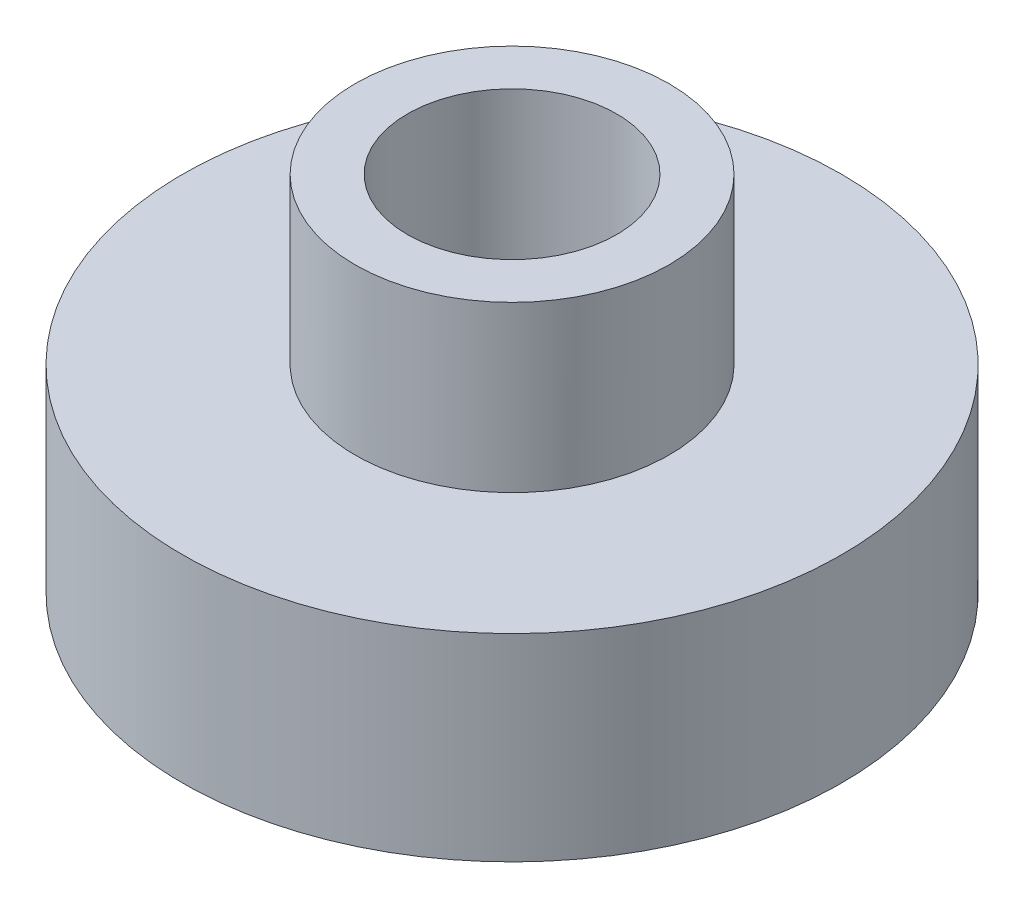
ISO-10303-21;
HEADER;
FILE_DESCRIPTION(('STEP AP214'),'2;1');
FILE_NAME('part.step','',(''),(''),'','','');
FILE_SCHEMA(('AUTOMOTIVE_DESIGN { 1 0 10303 214 1 1 1 1 }'));
ENDSEC;
DATA;
#1=APPLICATION_CONTEXT('core data for automotive mechanical design processes');
#2=APPLICATION_PROTOCOL_DEFINITION('international standard','automotive_design',2000,#1);
#3=PRODUCT_CONTEXT('',#1,'mechanical');
#4=PRODUCT('Part','Part','',(#3));
#5=PRODUCT_RELATED_PRODUCT_CATEGORY('part','',(#4));
#6=PRODUCT_DEFINITION_FORMATION('','',#4);
#7=PRODUCT_DEFINITION_CONTEXT('part definition',#1,'design');
#8=PRODUCT_DEFINITION('design','',#6,#7);
#9=PRODUCT_DEFINITION_SHAPE('','',#8);
#10=(LENGTH_UNIT() NAMED_UNIT(*) SI_UNIT(.MILLI.,.METRE.));
#11=(NAMED_UNIT(*) PLANE_ANGLE_UNIT() SI_UNIT($,.RADIAN.));
#12=(NAMED_UNIT(*) SI_UNIT($,.STERADIAN.) SOLID_ANGLE_UNIT());
#13=UNCERTAINTY_MEASURE_WITH_UNIT(LENGTH_MEASURE(1.E-05),#10,'distance_accuracy_value','');
#14=(GEOMETRIC_REPRESENTATION_CONTEXT(3) GLOBAL_UNCERTAINTY_ASSIGNED_CONTEXT((#13)) GLOBAL_UNIT_ASSIGNED_CONTEXT((#10,
#11,#12)) REPRESENTATION_CONTEXT('',''));
#15=CARTESIAN_POINT('',(0.,0.,0.));
#16=DIRECTION('',(0.,0.,1.));
#17=DIRECTION('',(1.,0.,0.));
#18=AXIS2_PLACEMENT_3D('',#15,#16,#17);
#19=CARTESIAN_POINT('',(0.,22.,0.));
#20=DIRECTION('',(0.,-1.,0.));
#21=DIRECTION('',(0.,0.,-1.));
#22=AXIS2_PLACEMENT_3D('',#19,#20,#21);
#23=CYLINDRICAL_SURFACE('',#22,9.525);
#24=CARTESIAN_POINT('',(0.,22.,0.));
#25=DIRECTION('',(0.,1.,0.));
#26=DIRECTION('',(0.,0.,1.));
#27=AXIS2_PLACEMENT_3D('',#24,#25,#26);
#28=CIRCLE('',#27,9.525);
#29=CARTESIAN_POINT('',(0.,22.,9.525));
#30=VERTEX_POINT('',#29);
#31=EDGE_CURVE('E39',#30,#30,#28,.T.);
#32=ORIENTED_EDGE('',*,*,#31,.F.);
#33=EDGE_LOOP('',(#32));
#34=FACE_BOUND('',#33,.T.);
#35=CARTESIAN_POINT('',(0.,12.,0.));
#36=DIRECTION('',(0.,-1.,0.));
#37=DIRECTION('',(0.,0.,-1.));
#38=AXIS2_PLACEMENT_3D('',#35,#36,#37);
#39=CIRCLE('',#38,9.525);
#40=CARTESIAN_POINT('',(0.,12.,-9.525));
#41=VERTEX_POINT('',#40);
#42=EDGE_CURVE('E10',#41,#41,#39,.T.);
#43=ORIENTED_EDGE('',*,*,#42,.F.);
#44=EDGE_LOOP('',(#43));
#45=FACE_BOUND('',#44,.T.);
#46=ADVANCED_FACE('F32',(#34,#45),#23,.T.);
#47=CARTESIAN_POINT('',(0.,22.,0.));
#48=DIRECTION('',(0.,-1.,0.));
#49=DIRECTION('',(0.,0.,-1.));
#50=AXIS2_PLACEMENT_3D('',#47,#48,#49);
#51=CYLINDRICAL_SURFACE('',#50,6.35);
#52=CARTESIAN_POINT('',(0.,22.,0.));
#53=DIRECTION('',(0.,1.,0.));
#54=DIRECTION('',(0.,0.,1.));
#55=AXIS2_PLACEMENT_3D('',#52,#53,#54);
#56=CIRCLE('',#55,6.35);
#57=CARTESIAN_POINT('',(0.,22.,6.35));
#58=VERTEX_POINT('',#57);
#59=EDGE_CURVE('E43',#58,#58,#56,.T.);
#60=ORIENTED_EDGE('',*,*,#59,.T.);
#61=EDGE_LOOP('',(#60));
#62=FACE_BOUND('',#61,.T.);
#63=CARTESIAN_POINT('',(0.,0.,0.));
#64=DIRECTION('',(0.,1.,0.));
#65=DIRECTION('',(0.,0.,1.));
#66=AXIS2_PLACEMENT_3D('',#63,#64,#65);
#67=CIRCLE('',#66,6.35);
#68=CARTESIAN_POINT('',(0.,0.,6.35));
#69=VERTEX_POINT('',#68);
#70=EDGE_CURVE('E48',#69,#69,#67,.T.);
#71=ORIENTED_EDGE('',*,*,#70,.F.);
#72=EDGE_LOOP('',(#71));
#73=FACE_BOUND('',#72,.T.);
#74=ADVANCED_FACE('F34',(#62,#73),#51,.F.);
#75=CARTESIAN_POINT('',(0.,22.,0.));
#76=DIRECTION('',(0.,1.,0.));
#77=DIRECTION('',(0.,0.,1.));
#78=AXIS2_PLACEMENT_3D('',#75,#76,#77);
#79=PLANE('',#78);
#80=ORIENTED_EDGE('',*,*,#59,.F.);
#81=EDGE_LOOP('',(#80));
#82=FACE_BOUND('',#81,.T.);
#83=ORIENTED_EDGE('',*,*,#31,.T.);
#84=EDGE_LOOP('',(#83));
#85=FACE_BOUND('',#84,.T.);
#86=ADVANCED_FACE('F74',(#82,#85),#79,.T.);
#87=CARTESIAN_POINT('',(0.,0.,0.));
#88=DIRECTION('',(0.,1.,0.));
#89=DIRECTION('',(0.,0.,1.));
#90=AXIS2_PLACEMENT_3D('',#87,#88,#89);
#91=PLANE('',#90);
#92=ORIENTED_EDGE('',*,*,#70,.T.);
#93=EDGE_LOOP('',(#92));
#94=FACE_BOUND('',#93,.T.);
#95=CARTESIAN_POINT('',(0.,0.,0.));
#96=DIRECTION('',(0.,-1.,0.));
#97=DIRECTION('',(0.,0.,-1.));
#98=AXIS2_PLACEMENT_3D('',#95,#96,#97);
#99=CIRCLE('',#98,20.);
#100=CARTESIAN_POINT('',(0.,0.,-20.));
#101=VERTEX_POINT('',#100);
#102=EDGE_CURVE('E56',#101,#101,#99,.T.);
#103=ORIENTED_EDGE('',*,*,#102,.T.);
#104=EDGE_LOOP('',(#103));
#105=FACE_BOUND('',#104,.T.);
#106=ADVANCED_FACE('F63',(#94,#105),#91,.F.);
#107=CARTESIAN_POINT('',(0.,12.,0.));
#108=DIRECTION('',(0.,-1.,0.));
#109=DIRECTION('',(0.,0.,-1.));
#110=AXIS2_PLACEMENT_3D('',#107,#108,#109);
#111=CYLINDRICAL_SURFACE('',#110,20.);
#112=CARTESIAN_POINT('',(0.,12.,0.));
#113=DIRECTION('',(0.,-1.,0.));
#114=DIRECTION('',(0.,0.,-1.));
#115=AXIS2_PLACEMENT_3D('',#112,#113,#114);
#116=CIRCLE('',#115,20.);
#117=CARTESIAN_POINT('',(0.,12.,-20.));
#118=VERTEX_POINT('',#117);
#119=EDGE_CURVE('E52',#118,#118,#116,.T.);
#120=ORIENTED_EDGE('',*,*,#119,.T.);
#121=EDGE_LOOP('',(#120));
#122=FACE_BOUND('',#121,.T.);
#123=ORIENTED_EDGE('',*,*,#102,.F.);
#124=EDGE_LOOP('',(#123));
#125=FACE_BOUND('',#124,.T.);
#126=ADVANCED_FACE('F65',(#122,#125),#111,.T.);
#127=CARTESIAN_POINT('',(0.,12.,0.));
#128=DIRECTION('',(0.,-1.,0.));
#129=DIRECTION('',(0.,0.,-1.));
#130=AXIS2_PLACEMENT_3D('',#127,#128,#129);
#131=PLANE('',#130);
#132=ORIENTED_EDGE('',*,*,#42,.T.);
#133=EDGE_LOOP('',(#132));
#134=FACE_BOUND('',#133,.T.);
#135=ORIENTED_EDGE('',*,*,#119,.F.);
#136=EDGE_LOOP('',(#135));
#137=FACE_BOUND('',#136,.T.);
#138=ADVANCED_FACE('F67',(#134,#137),#131,.F.);
#139=CLOSED_SHELL('',(#46,#74,#86,#106,#126,#138));
#140=MANIFOLD_SOLID_BREP('B2',#139);
#141=ADVANCED_BREP_SHAPE_REPRESENTATION('',(#18,#140),#14);
#142=SHAPE_DEFINITION_REPRESENTATION(#9,#141);
ENDSEC;
END-ISO-10303-21;
